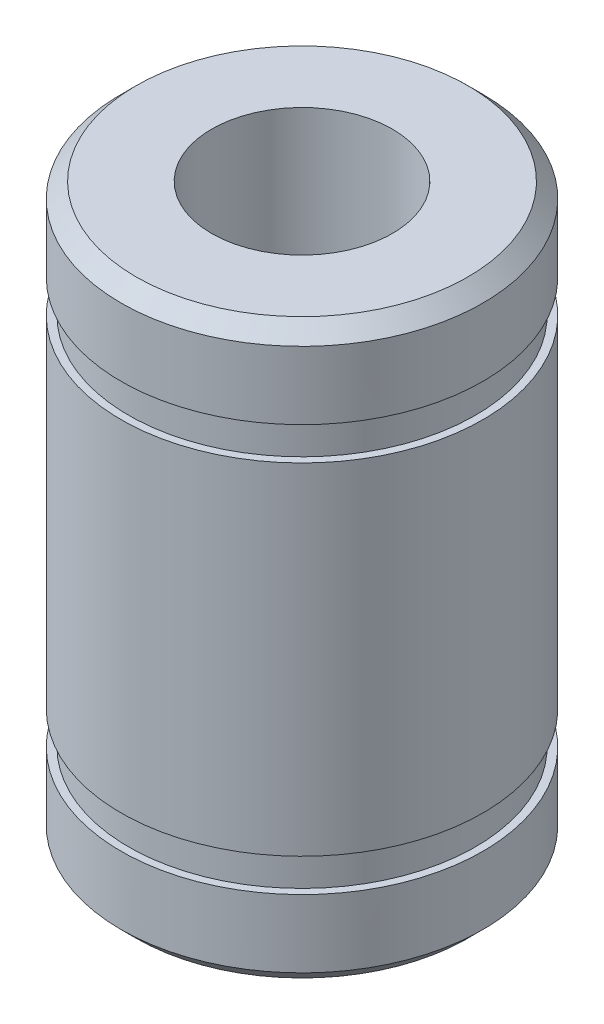
ISO-10303-21;
HEADER;
FILE_DESCRIPTION(('STEP AP214'),'2;1');
FILE_NAME('part.step','',(''),(''),'','','');
FILE_SCHEMA(('AUTOMOTIVE_DESIGN { 1 0 10303 214 1 1 1 1 }'));
ENDSEC;
DATA;
#1=APPLICATION_CONTEXT('core data for automotive mechanical design processes');
#2=APPLICATION_PROTOCOL_DEFINITION('international standard','automotive_design',2000,#1);
#3=PRODUCT_CONTEXT('',#1,'mechanical');
#4=PRODUCT('Part','Part','',(#3));
#5=PRODUCT_RELATED_PRODUCT_CATEGORY('part','',(#4));
#6=PRODUCT_DEFINITION_FORMATION('','',#4);
#7=PRODUCT_DEFINITION_CONTEXT('part definition',#1,'design');
#8=PRODUCT_DEFINITION('design','',#6,#7);
#9=PRODUCT_DEFINITION_SHAPE('','',#8);
#10=(LENGTH_UNIT() NAMED_UNIT(*) SI_UNIT(.MILLI.,.METRE.));
#11=(NAMED_UNIT(*) PLANE_ANGLE_UNIT() SI_UNIT($,.RADIAN.));
#12=(NAMED_UNIT(*) SI_UNIT($,.STERADIAN.) SOLID_ANGLE_UNIT());
#13=UNCERTAINTY_MEASURE_WITH_UNIT(LENGTH_MEASURE(1.E-05),#10,'distance_accuracy_value','');
#14=(GEOMETRIC_REPRESENTATION_CONTEXT(3) GLOBAL_UNCERTAINTY_ASSIGNED_CONTEXT((#13)) GLOBAL_UNIT_ASSIGNED_CONTEXT((#10,
#11,#12)) REPRESENTATION_CONTEXT('',''));
#15=CARTESIAN_POINT('',(0.,0.,0.));
#16=DIRECTION('',(0.,0.,1.));
#17=DIRECTION('',(1.,0.,0.));
#18=AXIS2_PLACEMENT_3D('',#15,#16,#17);
#19=CARTESIAN_POINT('',(0.,0.,0.));
#20=DIRECTION('',(0.,-1.,0.));
#21=DIRECTION('',(0.,0.,-1.));
#22=AXIS2_PLACEMENT_3D('',#19,#20,#21);
#23=CYLINDRICAL_SURFACE('',#22,3.);
#24=CARTESIAN_POINT('',(0.,9.5,0.));
#25=DIRECTION('',(0.,-1.,0.));
#26=DIRECTION('',(0.,0.,-1.));
#27=AXIS2_PLACEMENT_3D('',#24,#25,#26);
#28=CIRCLE('',#27,3.);
#29=CARTESIAN_POINT('',(0.,9.5,-3.));
#30=VERTEX_POINT('',#29);
#31=EDGE_CURVE('E42',#30,#30,#28,.T.);
#32=ORIENTED_EDGE('',*,*,#31,.F.);
#33=EDGE_LOOP('',(#32));
#34=FACE_BOUND('',#33,.T.);
#35=CARTESIAN_POINT('',(0.,-9.5,0.));
#36=DIRECTION('',(0.,-1.,0.));
#37=DIRECTION('',(0.,0.,-1.));
#38=AXIS2_PLACEMENT_3D('',#35,#36,#37);
#39=CIRCLE('',#38,3.);
#40=CARTESIAN_POINT('',(0.,-9.5,-3.));
#41=VERTEX_POINT('',#40);
#42=EDGE_CURVE('E66',#41,#41,#39,.T.);
#43=ORIENTED_EDGE('',*,*,#42,.T.);
#44=EDGE_LOOP('',(#43));
#45=FACE_BOUND('',#44,.T.);
#46=ADVANCED_FACE('F31',(#34,#45),#23,.F.);
#47=CARTESIAN_POINT('',(3.,9.5,0.));
#48=DIRECTION('',(0.,1.,0.));
#49=DIRECTION('',(0.,0.,1.));
#50=AXIS2_PLACEMENT_3D('',#47,#48,#49);
#51=PLANE('',#50);
#52=CARTESIAN_POINT('',(0.,9.5,0.));
#53=DIRECTION('',(0.,1.,0.));
#54=DIRECTION('',(0.,0.,1.));
#55=AXIS2_PLACEMENT_3D('',#52,#53,#54);
#56=CIRCLE('',#55,5.50000000000001);
#57=CARTESIAN_POINT('',(0.,9.5,5.50000000000001));
#58=VERTEX_POINT('',#57);
#59=EDGE_CURVE('E10',#58,#58,#56,.T.);
#60=ORIENTED_EDGE('',*,*,#59,.T.);
#61=EDGE_LOOP('',(#60));
#62=FACE_BOUND('',#61,.T.);
#63=ORIENTED_EDGE('',*,*,#31,.T.);
#64=EDGE_LOOP('',(#63));
#65=FACE_BOUND('',#64,.T.);
#66=ADVANCED_FACE('F100',(#62,#65),#51,.T.);
#67=CARTESIAN_POINT('',(0.,0.,0.));
#68=DIRECTION('',(0.,-1.,0.));
#69=DIRECTION('',(0.,0.,-1.));
#70=AXIS2_PLACEMENT_3D('',#67,#68,#69);
#71=CYLINDRICAL_SURFACE('',#70,6.);
#72=CARTESIAN_POINT('',(0.,9.00000000000001,0.));
#73=DIRECTION('',(0.,1.,0.));
#74=DIRECTION('',(0.,0.,1.));
#75=AXIS2_PLACEMENT_3D('',#72,#73,#74);
#76=CIRCLE('',#75,6.);
#77=CARTESIAN_POINT('',(0.,9.00000000000001,6.));
#78=VERTEX_POINT('',#77);
#79=EDGE_CURVE('E38',#78,#78,#76,.F.);
#80=ORIENTED_EDGE('',*,*,#79,.T.);
#81=EDGE_LOOP('',(#80));
#82=FACE_BOUND('',#81,.T.);
#83=CARTESIAN_POINT('',(0.,6.75,0.));
#84=DIRECTION('',(0.,-1.,0.));
#85=DIRECTION('',(0.,0.,-1.));
#86=AXIS2_PLACEMENT_3D('',#83,#84,#85);
#87=CIRCLE('',#86,6.);
#88=CARTESIAN_POINT('',(0.,6.75,-6.));
#89=VERTEX_POINT('',#88);
#90=EDGE_CURVE('E46',#89,#89,#87,.T.);
#91=ORIENTED_EDGE('',*,*,#90,.F.);
#92=EDGE_LOOP('',(#91));
#93=FACE_BOUND('',#92,.T.);
#94=ADVANCED_FACE('F105',(#82,#93),#71,.T.);
#95=CARTESIAN_POINT('',(6.,6.75,0.));
#96=DIRECTION('',(0.,-1.,0.));
#97=DIRECTION('',(0.,0.,-1.));
#98=AXIS2_PLACEMENT_3D('',#95,#96,#97);
#99=PLANE('',#98);
#100=ORIENTED_EDGE('',*,*,#90,.T.);
#101=EDGE_LOOP('',(#100));
#102=FACE_BOUND('',#101,.T.);
#103=CARTESIAN_POINT('',(0.,6.75,0.));
#104=DIRECTION('',(0.,-1.,0.));
#105=DIRECTION('',(0.,0.,-1.));
#106=AXIS2_PLACEMENT_3D('',#103,#104,#105);
#107=CIRCLE('',#106,5.75);
#108=CARTESIAN_POINT('',(0.,6.75,-5.75));
#109=VERTEX_POINT('',#108);
#110=EDGE_CURVE('E51',#109,#109,#107,.T.);
#111=ORIENTED_EDGE('',*,*,#110,.F.);
#112=EDGE_LOOP('',(#111));
#113=FACE_BOUND('',#112,.T.);
#114=ADVANCED_FACE('F112',(#102,#113),#99,.T.);
#115=CARTESIAN_POINT('',(0.,0.,0.));
#116=DIRECTION('',(0.,-1.,0.));
#117=DIRECTION('',(0.,0.,-1.));
#118=AXIS2_PLACEMENT_3D('',#115,#116,#117);
#119=CYLINDRICAL_SURFACE('',#118,5.75);
#120=ORIENTED_EDGE('',*,*,#110,.T.);
#121=EDGE_LOOP('',(#120));
#122=FACE_BOUND('',#121,.T.);
#123=CARTESIAN_POINT('',(0.,5.65,0.));
#124=DIRECTION('',(0.,-1.,0.));
#125=DIRECTION('',(0.,0.,-1.));
#126=AXIS2_PLACEMENT_3D('',#123,#124,#125);
#127=CIRCLE('',#126,5.75);
#128=CARTESIAN_POINT('',(0.,5.65,-5.75));
#129=VERTEX_POINT('',#128);
#130=EDGE_CURVE('E54',#129,#129,#127,.T.);
#131=ORIENTED_EDGE('',*,*,#130,.F.);
#132=EDGE_LOOP('',(#131));
#133=FACE_BOUND('',#132,.T.);
#134=ADVANCED_FACE('F95',(#122,#133),#119,.T.);
#135=CARTESIAN_POINT('',(5.75,5.65,0.));
#136=DIRECTION('',(0.,1.,0.));
#137=DIRECTION('',(0.,0.,1.));
#138=AXIS2_PLACEMENT_3D('',#135,#136,#137);
#139=PLANE('',#138);
#140=ORIENTED_EDGE('',*,*,#130,.T.);
#141=EDGE_LOOP('',(#140));
#142=FACE_BOUND('',#141,.T.);
#143=CARTESIAN_POINT('',(0.,5.65,0.));
#144=DIRECTION('',(0.,-1.,0.));
#145=DIRECTION('',(0.,0.,-1.));
#146=AXIS2_PLACEMENT_3D('',#143,#144,#145);
#147=CIRCLE('',#146,6.);
#148=CARTESIAN_POINT('',(0.,5.65,-6.));
#149=VERTEX_POINT('',#148);
#150=EDGE_CURVE('E57',#149,#149,#147,.T.);
#151=ORIENTED_EDGE('',*,*,#150,.F.);
#152=EDGE_LOOP('',(#151));
#153=FACE_BOUND('',#152,.T.);
#154=ADVANCED_FACE('F86',(#142,#153),#139,.T.);
#155=CARTESIAN_POINT('',(0.,0.,0.));
#156=DIRECTION('',(0.,-1.,0.));
#157=DIRECTION('',(0.,0.,-1.));
#158=AXIS2_PLACEMENT_3D('',#155,#156,#157);
#159=CYLINDRICAL_SURFACE('',#158,6.);
#160=ORIENTED_EDGE('',*,*,#150,.T.);
#161=EDGE_LOOP('',(#160));
#162=FACE_BOUND('',#161,.T.);
#163=CARTESIAN_POINT('',(0.,-5.65,0.));
#164=DIRECTION('',(0.,-1.,0.));
#165=DIRECTION('',(0.,0.,-1.));
#166=AXIS2_PLACEMENT_3D('',#163,#164,#165);
#167=CIRCLE('',#166,6.);
#168=CARTESIAN_POINT('',(0.,-5.65,-6.));
#169=VERTEX_POINT('',#168);
#170=EDGE_CURVE('E78',#169,#169,#167,.T.);
#171=ORIENTED_EDGE('',*,*,#170,.F.);
#172=EDGE_LOOP('',(#171));
#173=FACE_BOUND('',#172,.T.);
#174=ADVANCED_FACE('F84',(#162,#173),#159,.T.);
#175=CARTESIAN_POINT('',(0.,9.00000000000001,0.));
#176=DIRECTION('',(0.,-1.,0.));
#177=DIRECTION('',(0.,0.,-1.));
#178=AXIS2_PLACEMENT_3D('',#175,#176,#177);
#179=CONICAL_SURFACE('',#178,6.,0.785398163397451);
#180=ORIENTED_EDGE('',*,*,#59,.F.);
#181=EDGE_LOOP('',(#180));
#182=FACE_BOUND('',#181,.T.);
#183=ORIENTED_EDGE('',*,*,#79,.F.);
#184=EDGE_LOOP('',(#183));
#185=FACE_BOUND('',#184,.T.);
#186=ADVANCED_FACE('F33',(#182,#185),#179,.T.);
#187=CARTESIAN_POINT('',(3.,-9.5,0.));
#188=DIRECTION('',(0.,-1.,0.));
#189=DIRECTION('',(0.,0.,1.));
#190=AXIS2_PLACEMENT_3D('',#187,#188,#189);
#191=PLANE('',#190);
#192=CARTESIAN_POINT('',(0.,-9.5,0.));
#193=DIRECTION('',(0.,1.,0.));
#194=DIRECTION('',(0.,0.,1.));
#195=AXIS2_PLACEMENT_3D('',#192,#193,#194);
#196=CIRCLE('',#195,5.50000000000001);
#197=CARTESIAN_POINT('',(0.,-9.5,5.50000000000001));
#198=VERTEX_POINT('',#197);
#199=EDGE_CURVE('E60',#198,#198,#196,.T.);
#200=ORIENTED_EDGE('',*,*,#199,.F.);
#201=EDGE_LOOP('',(#200));
#202=FACE_BOUND('',#201,.T.);
#203=ORIENTED_EDGE('',*,*,#42,.F.);
#204=EDGE_LOOP('',(#203));
#205=FACE_BOUND('',#204,.T.);
#206=ADVANCED_FACE('F93',(#202,#205),#191,.T.);
#207=CARTESIAN_POINT('',(0.,0.,0.));
#208=DIRECTION('',(0.,1.,0.));
#209=DIRECTION('',(0.,0.,-1.));
#210=AXIS2_PLACEMENT_3D('',#207,#208,#209);
#211=CYLINDRICAL_SURFACE('',#210,6.);
#212=CARTESIAN_POINT('',(0.,-9.00000000000001,0.));
#213=DIRECTION('',(0.,1.,0.));
#214=DIRECTION('',(0.,0.,1.));
#215=AXIS2_PLACEMENT_3D('',#212,#213,#214);
#216=CIRCLE('',#215,6.);
#217=CARTESIAN_POINT('',(0.,-9.00000000000001,6.));
#218=VERTEX_POINT('',#217);
#219=EDGE_CURVE('E63',#218,#218,#216,.F.);
#220=ORIENTED_EDGE('',*,*,#219,.F.);
#221=EDGE_LOOP('',(#220));
#222=FACE_BOUND('',#221,.T.);
#223=CARTESIAN_POINT('',(0.,-6.75,0.));
#224=DIRECTION('',(0.,-1.,0.));
#225=DIRECTION('',(0.,0.,-1.));
#226=AXIS2_PLACEMENT_3D('',#223,#224,#225);
#227=CIRCLE('',#226,6.);
#228=CARTESIAN_POINT('',(0.,-6.75,-6.));
#229=VERTEX_POINT('',#228);
#230=EDGE_CURVE('E69',#229,#229,#227,.T.);
#231=ORIENTED_EDGE('',*,*,#230,.T.);
#232=EDGE_LOOP('',(#231));
#233=FACE_BOUND('',#232,.T.);
#234=ADVANCED_FACE('F175',(#222,#233),#211,.T.);
#235=CARTESIAN_POINT('',(6.,-6.75,0.));
#236=DIRECTION('',(0.,1.,0.));
#237=DIRECTION('',(0.,0.,-1.));
#238=AXIS2_PLACEMENT_3D('',#235,#236,#237);
#239=PLANE('',#238);
#240=ORIENTED_EDGE('',*,*,#230,.F.);
#241=EDGE_LOOP('',(#240));
#242=FACE_BOUND('',#241,.T.);
#243=CARTESIAN_POINT('',(0.,-6.75,0.));
#244=DIRECTION('',(0.,-1.,0.));
#245=DIRECTION('',(0.,0.,-1.));
#246=AXIS2_PLACEMENT_3D('',#243,#244,#245);
#247=CIRCLE('',#246,5.75);
#248=CARTESIAN_POINT('',(0.,-6.75,-5.75));
#249=VERTEX_POINT('',#248);
#250=EDGE_CURVE('E72',#249,#249,#247,.T.);
#251=ORIENTED_EDGE('',*,*,#250,.T.);
#252=EDGE_LOOP('',(#251));
#253=FACE_BOUND('',#252,.T.);
#254=ADVANCED_FACE('F185',(#242,#253),#239,.T.);
#255=CARTESIAN_POINT('',(0.,0.,0.));
#256=DIRECTION('',(0.,1.,0.));
#257=DIRECTION('',(0.,0.,-1.));
#258=AXIS2_PLACEMENT_3D('',#255,#256,#257);
#259=CYLINDRICAL_SURFACE('',#258,5.75);
#260=ORIENTED_EDGE('',*,*,#250,.F.);
#261=EDGE_LOOP('',(#260));
#262=FACE_BOUND('',#261,.T.);
#263=CARTESIAN_POINT('',(0.,-5.65,0.));
#264=DIRECTION('',(0.,-1.,0.));
#265=DIRECTION('',(0.,0.,-1.));
#266=AXIS2_PLACEMENT_3D('',#263,#264,#265);
#267=CIRCLE('',#266,5.75);
#268=CARTESIAN_POINT('',(0.,-5.65,-5.75));
#269=VERTEX_POINT('',#268);
#270=EDGE_CURVE('E75',#269,#269,#267,.T.);
#271=ORIENTED_EDGE('',*,*,#270,.T.);
#272=EDGE_LOOP('',(#271));
#273=FACE_BOUND('',#272,.T.);
#274=ADVANCED_FACE('F195',(#262,#273),#259,.T.);
#275=CARTESIAN_POINT('',(5.75,-5.65,0.));
#276=DIRECTION('',(0.,-1.,0.));
#277=DIRECTION('',(0.,0.,1.));
#278=AXIS2_PLACEMENT_3D('',#275,#276,#277);
#279=PLANE('',#278);
#280=ORIENTED_EDGE('',*,*,#270,.F.);
#281=EDGE_LOOP('',(#280));
#282=FACE_BOUND('',#281,.T.);
#283=ORIENTED_EDGE('',*,*,#170,.T.);
#284=EDGE_LOOP('',(#283));
#285=FACE_BOUND('',#284,.T.);
#286=ADVANCED_FACE('F82',(#282,#285),#279,.T.);
#287=CARTESIAN_POINT('',(0.,-9.00000000000001,0.));
#288=DIRECTION('',(0.,1.,0.));
#289=DIRECTION('',(0.,0.,-1.));
#290=AXIS2_PLACEMENT_3D('',#287,#288,#289);
#291=CONICAL_SURFACE('',#290,6.,0.785398163397451);
#292=ORIENTED_EDGE('',*,*,#199,.T.);
#293=EDGE_LOOP('',(#292));
#294=FACE_BOUND('',#293,.T.);
#295=ORIENTED_EDGE('',*,*,#219,.T.);
#296=EDGE_LOOP('',(#295));
#297=FACE_BOUND('',#296,.T.);
#298=ADVANCED_FACE('F214',(#294,#297),#291,.T.);
#299=CLOSED_SHELL('',(#46,#66,#94,#114,#134,#154,#174,#186,#206,#234,#254,#274,#286,#298));
#300=MANIFOLD_SOLID_BREP('B2',#299);
#301=ADVANCED_BREP_SHAPE_REPRESENTATION('',(#18,#300),#14);
#302=SHAPE_DEFINITION_REPRESENTATION(#9,#301);
ENDSEC;
END-ISO-10303-21;
